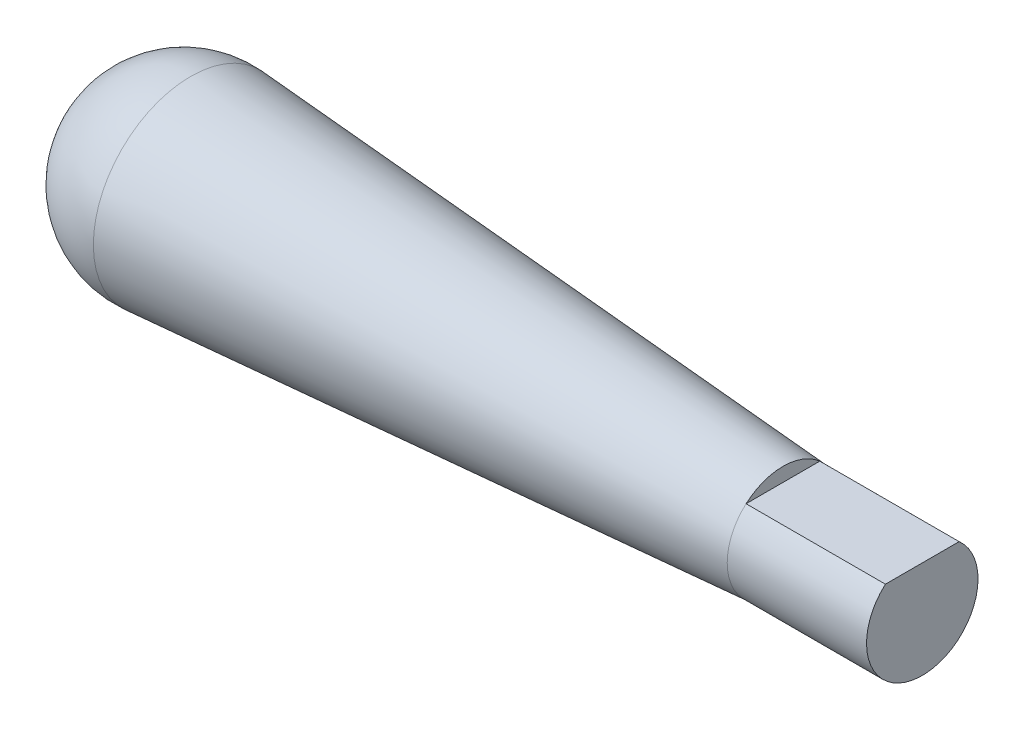
ISO-10303-21;
HEADER;
FILE_DESCRIPTION(('STEP AP214'),'2;1');
FILE_NAME('part.step','',(''),(''),'','','');
FILE_SCHEMA(('AUTOMOTIVE_DESIGN { 1 0 10303 214 1 1 1 1 }'));
ENDSEC;
DATA;
#1=APPLICATION_CONTEXT('core data for automotive mechanical design processes');
#2=APPLICATION_PROTOCOL_DEFINITION('international standard','automotive_design',2000,#1);
#3=PRODUCT_CONTEXT('',#1,'mechanical');
#4=PRODUCT('Part','Part','',(#3));
#5=PRODUCT_RELATED_PRODUCT_CATEGORY('part','',(#4));
#6=PRODUCT_DEFINITION_FORMATION('','',#4);
#7=PRODUCT_DEFINITION_CONTEXT('part definition',#1,'design');
#8=PRODUCT_DEFINITION('design','',#6,#7);
#9=PRODUCT_DEFINITION_SHAPE('','',#8);
#10=(LENGTH_UNIT() NAMED_UNIT(*) SI_UNIT(.MILLI.,.METRE.));
#11=(NAMED_UNIT(*) PLANE_ANGLE_UNIT() SI_UNIT($,.RADIAN.));
#12=(NAMED_UNIT(*) SI_UNIT($,.STERADIAN.) SOLID_ANGLE_UNIT());
#13=UNCERTAINTY_MEASURE_WITH_UNIT(LENGTH_MEASURE(1.E-05),#10,'distance_accuracy_value','');
#14=(GEOMETRIC_REPRESENTATION_CONTEXT(3) GLOBAL_UNCERTAINTY_ASSIGNED_CONTEXT((#13)) GLOBAL_UNIT_ASSIGNED_CONTEXT((#10,
#11,#12)) REPRESENTATION_CONTEXT('',''));
#15=CARTESIAN_POINT('',(0.,0.,0.));
#16=DIRECTION('',(0.,0.,1.));
#17=DIRECTION('',(1.,0.,0.));
#18=AXIS2_PLACEMENT_3D('',#15,#16,#17);
#19=CARTESIAN_POINT('',(7.,0.,0.));
#20=DIRECTION('',(-1.,0.,0.));
#21=DIRECTION('',(0.,1.,0.));
#22=AXIS2_PLACEMENT_3D('',#19,#20,#21);
#23=SPHERICAL_SURFACE('',#22,7.);
#24=CARTESIAN_POINT('',(7.48996919992005,0.,0.));
#25=DIRECTION('',(-1.,0.,0.));
#26=DIRECTION('',(0.,0.,1.));
#27=AXIS2_PLACEMENT_3D('',#24,#25,#26);
#28=CIRCLE('',#27,6.98283110085943);
#29=CARTESIAN_POINT('',(7.48996919992005,0.,6.98283110085943));
#30=VERTEX_POINT('',#29);
#31=EDGE_CURVE('E73',#30,#30,#28,.T.);
#32=ORIENTED_EDGE('',*,*,#31,.T.);
#33=EDGE_LOOP('',(#32));
#34=FACE_BOUND('',#33,.T.);
#35=ADVANCED_FACE('F34',(#34),#23,.T.);
#36=CARTESIAN_POINT('',(60.,0.,0.));
#37=DIRECTION('',(-1.,0.,0.));
#38=DIRECTION('',(0.,0.,1.));
#39=AXIS2_PLACEMENT_3D('',#36,#37,#38);
#40=PLANE('',#39);
#41=CARTESIAN_POINT('',(60.,0.,0.));
#42=DIRECTION('',(-1.,0.,0.));
#43=DIRECTION('',(0.,0.,1.));
#44=AXIS2_PLACEMENT_3D('',#41,#42,#43);
#45=CIRCLE('',#44,4.);
#46=CARTESIAN_POINT('',(60.,3.,-2.64575131106459));
#47=VERTEX_POINT('',#46);
#48=CARTESIAN_POINT('',(60.,3.,2.64575131106459));
#49=VERTEX_POINT('',#48);
#50=EDGE_CURVE('E11',#47,#49,#45,.T.);
#51=ORIENTED_EDGE('',*,*,#50,.F.);
#52=DIRECTION('',(0.,0.,-1.));
#53=VECTOR('',#52,1.);
#54=CARTESIAN_POINT('',(60.,3.,8.59779753729005));
#55=LINE('',#54,#53);
#56=EDGE_CURVE('E54',#49,#47,#55,.T.);
#57=ORIENTED_EDGE('',*,*,#56,.F.);
#58=EDGE_LOOP('',(#51,#57));
#59=FACE_BOUND('',#58,.T.);
#60=ADVANCED_FACE('F81',(#59),#40,.F.);
#61=CARTESIAN_POINT('',(0.,0.,0.));
#62=DIRECTION('',(-1.,0.,0.));
#63=DIRECTION('',(0.,0.,1.));
#64=AXIS2_PLACEMENT_3D('',#61,#62,#63);
#65=CYLINDRICAL_SURFACE('',#64,4.);
#66=ORIENTED_EDGE('',*,*,#50,.T.);
#67=DIRECTION('',(-1.,0.,0.));
#68=VECTOR('',#67,1.);
#69=CARTESIAN_POINT('',(0.,3.,2.64575131106459));
#70=LINE('',#69,#68);
#71=CARTESIAN_POINT('',(50.,3.,2.64575131106459));
#72=VERTEX_POINT('',#71);
#73=EDGE_CURVE('E66',#49,#72,#70,.T.);
#74=ORIENTED_EDGE('',*,*,#73,.T.);
#75=CARTESIAN_POINT('',(50.,0.,0.));
#76=DIRECTION('',(-1.,0.,0.));
#77=DIRECTION('',(0.,0.,1.));
#78=AXIS2_PLACEMENT_3D('',#75,#76,#77);
#79=CIRCLE('',#78,4.);
#80=CARTESIAN_POINT('',(50.,3.,-2.64575131106459));
#81=VERTEX_POINT('',#80);
#82=EDGE_CURVE('E63',#81,#72,#79,.T.);
#83=ORIENTED_EDGE('',*,*,#82,.F.);
#84=DIRECTION('',(-1.,0.,0.));
#85=VECTOR('',#84,1.);
#86=CARTESIAN_POINT('',(0.,3.,-2.64575131106459));
#87=LINE('',#86,#85);
#88=EDGE_CURVE('E67',#81,#47,#87,.F.);
#89=ORIENTED_EDGE('',*,*,#88,.T.);
#90=EDGE_LOOP('',(#66,#74,#83,#89));
#91=FACE_BOUND('',#90,.T.);
#92=ADVANCED_FACE('F71',(#91),#65,.T.);
#93=CARTESIAN_POINT('',(50.,0.,0.));
#94=DIRECTION('',(-1.,0.,0.));
#95=DIRECTION('',(0.,0.,1.));
#96=AXIS2_PLACEMENT_3D('',#93,#94,#95);
#97=CONICAL_SURFACE('',#96,4.,0.0700528822575048);
#98=ORIENTED_EDGE('',*,*,#31,.F.);
#99=EDGE_LOOP('',(#98));
#100=FACE_BOUND('',#99,.T.);
#101=EDGE_CURVE('E41',#72,#81,#79,.T.);
#102=ORIENTED_EDGE('',*,*,#101,.T.);
#103=ORIENTED_EDGE('',*,*,#82,.T.);
#104=EDGE_LOOP('',(#102,#103));
#105=FACE_BOUND('',#104,.T.);
#106=ADVANCED_FACE('F75',(#100,#105),#97,.T.);
#107=CARTESIAN_POINT('',(50.,3.,8.59779753729005));
#108=DIRECTION('',(0.,-1.,0.));
#109=DIRECTION('',(0.,0.,-1.));
#110=AXIS2_PLACEMENT_3D('',#107,#108,#109);
#111=PLANE('',#110);
#112=ORIENTED_EDGE('',*,*,#56,.T.);
#113=ORIENTED_EDGE('',*,*,#88,.F.);
#114=DIRECTION('',(0.,0.,-1.));
#115=VECTOR('',#114,1.);
#116=CARTESIAN_POINT('',(50.,3.,8.59779753729005));
#117=LINE('',#116,#115);
#118=EDGE_CURVE('E47',#72,#81,#117,.T.);
#119=ORIENTED_EDGE('',*,*,#118,.F.);
#120=ORIENTED_EDGE('',*,*,#73,.F.);
#121=EDGE_LOOP('',(#112,#113,#119,#120));
#122=FACE_BOUND('',#121,.T.);
#123=ADVANCED_FACE('F65',(#122),#111,.F.);
#124=CARTESIAN_POINT('',(50.,0.,0.));
#125=DIRECTION('',(1.,0.,0.));
#126=DIRECTION('',(0.,0.,-1.));
#127=AXIS2_PLACEMENT_3D('',#124,#125,#126);
#128=PLANE('',#127);
#129=ORIENTED_EDGE('',*,*,#101,.F.);
#130=ORIENTED_EDGE('',*,*,#118,.T.);
#131=EDGE_LOOP('',(#129,#130));
#132=FACE_BOUND('',#131,.T.);
#133=ADVANCED_FACE('F60',(#132),#128,.T.);
#134=CLOSED_SHELL('',(#35,#60,#92,#106,#123,#133));
#135=MANIFOLD_SOLID_BREP('B2',#134);
#136=ADVANCED_BREP_SHAPE_REPRESENTATION('',(#18,#135),#14);
#137=SHAPE_DEFINITION_REPRESENTATION(#9,#136);
ENDSEC;
END-ISO-10303-21;
